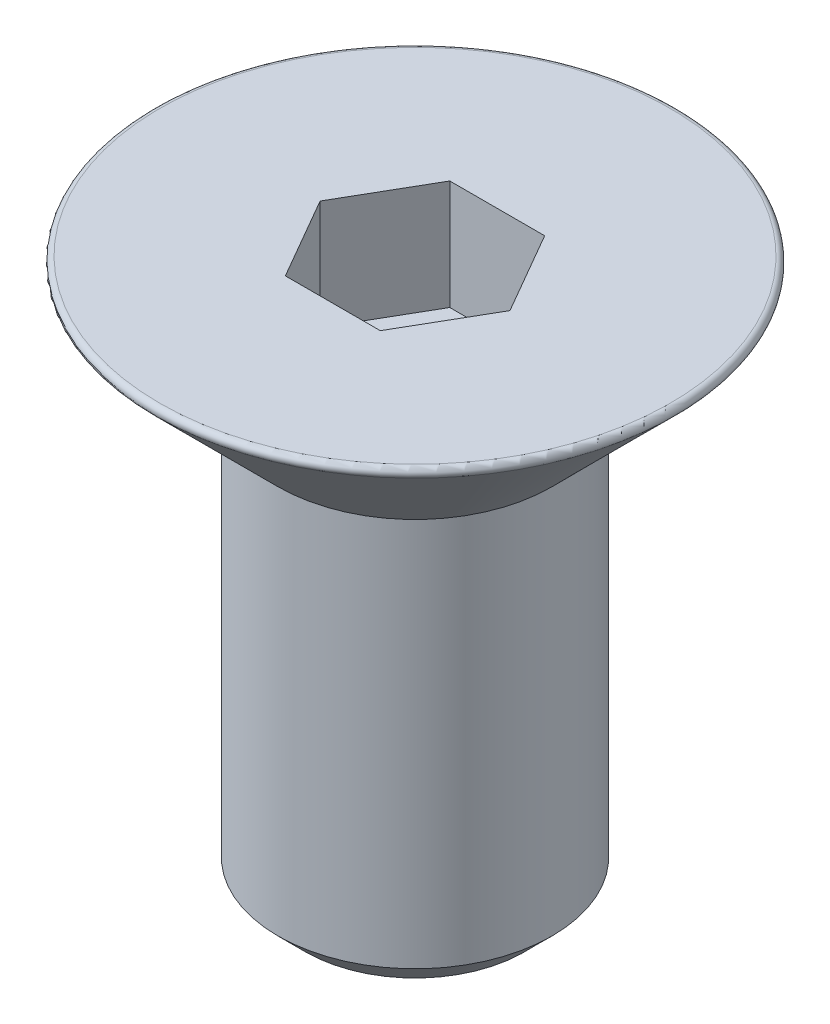
ISO-10303-21;
HEADER;
FILE_DESCRIPTION(('STEP AP214'),'2;1');
FILE_NAME('part.step','',(''),(''),'','','');
FILE_SCHEMA(('AUTOMOTIVE_DESIGN { 1 0 10303 214 1 1 1 1 }'));
ENDSEC;
DATA;
#1=APPLICATION_CONTEXT('core data for automotive mechanical design processes');
#2=APPLICATION_PROTOCOL_DEFINITION('international standard','automotive_design',2000,#1);
#3=PRODUCT_CONTEXT('',#1,'mechanical');
#4=PRODUCT('Part','Part','',(#3));
#5=PRODUCT_RELATED_PRODUCT_CATEGORY('part','',(#4));
#6=PRODUCT_DEFINITION_FORMATION('','',#4);
#7=PRODUCT_DEFINITION_CONTEXT('part definition',#1,'design');
#8=PRODUCT_DEFINITION('design','',#6,#7);
#9=PRODUCT_DEFINITION_SHAPE('','',#8);
#10=(LENGTH_UNIT() NAMED_UNIT(*) SI_UNIT(.MILLI.,.METRE.));
#11=(NAMED_UNIT(*) PLANE_ANGLE_UNIT() SI_UNIT($,.RADIAN.));
#12=(NAMED_UNIT(*) SI_UNIT($,.STERADIAN.) SOLID_ANGLE_UNIT());
#13=UNCERTAINTY_MEASURE_WITH_UNIT(LENGTH_MEASURE(1.E-05),#10,'distance_accuracy_value','');
#14=(GEOMETRIC_REPRESENTATION_CONTEXT(3) GLOBAL_UNCERTAINTY_ASSIGNED_CONTEXT((#13)) GLOBAL_UNIT_ASSIGNED_CONTEXT((#10,
#11,#12)) REPRESENTATION_CONTEXT('',''));
#15=CARTESIAN_POINT('',(0.,0.,0.));
#16=DIRECTION('',(0.,0.,1.));
#17=DIRECTION('',(1.,0.,0.));
#18=AXIS2_PLACEMENT_3D('',#15,#16,#17);
#19=CARTESIAN_POINT('',(0.,0.,0.));
#20=DIRECTION('',(0.,-1.,0.));
#21=DIRECTION('',(0.,0.,-1.));
#22=AXIS2_PLACEMENT_3D('',#19,#20,#21);
#23=PLANE('',#22);
#24=CARTESIAN_POINT('',(0.,-5.6843418860808E-11,0.));
#25=DIRECTION('',(0.,1.,0.));
#26=DIRECTION('',(0.,0.,1.));
#27=AXIS2_PLACEMENT_3D('',#24,#25,#26);
#28=CIRCLE('',#27,2.00000000000955);
#29=CARTESIAN_POINT('',(0.,-5.6843418860808E-11,2.00000000000955));
#30=VERTEX_POINT('',#29);
#31=EDGE_CURVE('E21',#30,#30,#28,.T.);
#32=ORIENTED_EDGE('',*,*,#31,.F.);
#33=EDGE_LOOP('',(#32));
#34=FACE_BOUND('',#33,.T.);
#35=ADVANCED_FACE('F17',(#34),#23,.T.);
#36=CARTESIAN_POINT('',(0.,0.499999999988177,0.));
#37=DIRECTION('',(0.,1.,0.));
#38=DIRECTION('',(0.,0.,1.));
#39=AXIS2_PLACEMENT_3D('',#36,#37,#38);
#40=CONICAL_SURFACE('',#39,2.49999999994088,0.785398163283761);
#41=ORIENTED_EDGE('',*,*,#31,.T.);
#42=EDGE_LOOP('',(#41));
#43=FACE_BOUND('',#42,.T.);
#44=CARTESIAN_POINT('',(0.,0.500000000000005,0.));
#45=DIRECTION('',(0.,-1.,0.));
#46=DIRECTION('',(0.,0.,-1.));
#47=AXIS2_PLACEMENT_3D('',#44,#45,#46);
#48=CIRCLE('',#47,2.5);
#49=CARTESIAN_POINT('',(0.,0.500000000000005,-2.5));
#50=VERTEX_POINT('',#49);
#51=EDGE_CURVE('E90',#50,#50,#48,.F.);
#52=ORIENTED_EDGE('',*,*,#51,.F.);
#53=EDGE_LOOP('',(#52));
#54=FACE_BOUND('',#53,.T.);
#55=ADVANCED_FACE('F181',(#43,#54),#40,.T.);
#56=CARTESIAN_POINT('',(0.,0.,0.));
#57=DIRECTION('',(0.,-1.,0.));
#58=DIRECTION('',(0.,0.,-1.));
#59=AXIS2_PLACEMENT_3D('',#56,#57,#58);
#60=CYLINDRICAL_SURFACE('',#59,2.5);
#61=CARTESIAN_POINT('',(0.,7.60000000008176,0.));
#62=DIRECTION('',(0.,1.,0.));
#63=DIRECTION('',(0.,0.,1.));
#64=AXIS2_PLACEMENT_3D('',#61,#62,#63);
#65=CIRCLE('',#64,2.49999999999773);
#66=CARTESIAN_POINT('',(0.,7.60000000008176,2.49999999999773));
#67=VERTEX_POINT('',#66);
#68=EDGE_CURVE('E82',#67,#67,#65,.T.);
#69=ORIENTED_EDGE('',*,*,#68,.F.);
#70=EDGE_LOOP('',(#69));
#71=FACE_BOUND('',#70,.T.);
#72=ORIENTED_EDGE('',*,*,#51,.T.);
#73=EDGE_LOOP('',(#72));
#74=FACE_BOUND('',#73,.T.);
#75=ADVANCED_FACE('F178',(#71,#74),#60,.T.);
#76=CARTESIAN_POINT('',(0.866025403784438,8.,1.5));
#77=DIRECTION('',(0.866025403784439,0.,0.5));
#78=DIRECTION('',(0.5,0.,-0.866025403784439));
#79=AXIS2_PLACEMENT_3D('',#76,#77,#78);
#80=PLANE('',#79);
#81=DIRECTION('',(0.5,0.,-0.866025403784439));
#82=VECTOR('',#81,1.);
#83=CARTESIAN_POINT('',(0.866025403784438,8.,1.5));
#84=LINE('',#83,#82);
#85=CARTESIAN_POINT('',(0.866025403784438,8.,1.5));
#86=VERTEX_POINT('',#85);
#87=CARTESIAN_POINT('',(1.73205080756888,8.,0.));
#88=VERTEX_POINT('',#87);
#89=EDGE_CURVE('E66',#86,#88,#84,.T.);
#90=ORIENTED_EDGE('',*,*,#89,.F.);
#91=DIRECTION('',(0.,1.,0.));
#92=VECTOR('',#91,1.);
#93=CARTESIAN_POINT('',(0.866025403784439,8.,1.5));
#94=LINE('',#93,#92);
#95=CARTESIAN_POINT('',(0.866025403784438,10.,1.5));
#96=VERTEX_POINT('',#95);
#97=EDGE_CURVE('E88',#86,#96,#94,.T.);
#98=ORIENTED_EDGE('',*,*,#97,.T.);
#99=DIRECTION('',(0.5,0.,-0.866025403784439));
#100=VECTOR('',#99,1.);
#101=CARTESIAN_POINT('',(0.866025403784438,10.,1.5));
#102=LINE('',#101,#100);
#103=CARTESIAN_POINT('',(1.73205080756888,10.,0.));
#104=VERTEX_POINT('',#103);
#105=EDGE_CURVE('E74',#104,#96,#102,.F.);
#106=ORIENTED_EDGE('',*,*,#105,.F.);
#107=DIRECTION('',(0.,1.,0.));
#108=VECTOR('',#107,1.);
#109=CARTESIAN_POINT('',(1.73205080756888,8.,0.));
#110=LINE('',#109,#108);
#111=EDGE_CURVE('E81',#104,#88,#110,.F.);
#112=ORIENTED_EDGE('',*,*,#111,.T.);
#113=EDGE_LOOP('',(#90,#98,#106,#112));
#114=FACE_BOUND('',#113,.T.);
#115=ADVANCED_FACE('F85',(#114),#80,.F.);
#116=CARTESIAN_POINT('',(0.,9.82928932194227,0.));
#117=DIRECTION('',(0.,1.,0.));
#118=DIRECTION('',(0.,0.,1.));
#119=AXIS2_PLACEMENT_3D('',#116,#117,#118);
#120=CONICAL_SURFACE('',#119,4.72928932174455,0.78539816337195);
#121=ORIENTED_EDGE('',*,*,#68,.T.);
#122=EDGE_LOOP('',(#121));
#123=FACE_BOUND('',#122,.T.);
#124=CARTESIAN_POINT('',(0.,9.82928932183933,0.));
#125=DIRECTION('',(0.,1.,0.));
#126=DIRECTION('',(0.,0.,1.));
#127=AXIS2_PLACEMENT_3D('',#124,#125,#126);
#128=CIRCLE('',#127,4.72928932183933);
#129=CARTESIAN_POINT('',(0.,9.82928932183933,4.72928932183933));
#130=VERTEX_POINT('',#129);
#131=EDGE_CURVE('E99',#130,#130,#128,.T.);
#132=ORIENTED_EDGE('',*,*,#131,.F.);
#133=EDGE_LOOP('',(#132));
#134=FACE_BOUND('',#133,.T.);
#135=ADVANCED_FACE('F172',(#123,#134),#120,.T.);
#136=CARTESIAN_POINT('',(1.73205080756888,8.,0.));
#137=DIRECTION('',(0.866025403784438,0.,-0.5));
#138=DIRECTION('',(-0.5,0.,-0.866025403784438));
#139=AXIS2_PLACEMENT_3D('',#136,#137,#138);
#140=PLANE('',#139);
#141=DIRECTION('',(-0.5,0.,-0.866025403784438));
#142=VECTOR('',#141,1.);
#143=CARTESIAN_POINT('',(1.73205080756888,8.,0.));
#144=LINE('',#143,#142);
#145=CARTESIAN_POINT('',(0.866025403784438,8.,-1.5));
#146=VERTEX_POINT('',#145);
#147=EDGE_CURVE('E93',#88,#146,#144,.T.);
#148=ORIENTED_EDGE('',*,*,#147,.F.);
#149=ORIENTED_EDGE('',*,*,#111,.F.);
#150=DIRECTION('',(-0.5,0.,-0.866025403784438));
#151=VECTOR('',#150,1.);
#152=CARTESIAN_POINT('',(1.73205080756888,10.,0.));
#153=LINE('',#152,#151);
#154=CARTESIAN_POINT('',(0.866025403784438,10.,-1.5));
#155=VERTEX_POINT('',#154);
#156=EDGE_CURVE('E70',#155,#104,#153,.F.);
#157=ORIENTED_EDGE('',*,*,#156,.F.);
#158=DIRECTION('',(0.,1.,0.));
#159=VECTOR('',#158,1.);
#160=CARTESIAN_POINT('',(0.866025403784438,8.,-1.5));
#161=LINE('',#160,#159);
#162=EDGE_CURVE('E131',#155,#146,#161,.F.);
#163=ORIENTED_EDGE('',*,*,#162,.T.);
#164=EDGE_LOOP('',(#148,#149,#157,#163));
#165=FACE_BOUND('',#164,.T.);
#166=ADVANCED_FACE('F92',(#165),#140,.F.);
#167=CARTESIAN_POINT('',(-0.866025403784439,8.,1.5));
#168=DIRECTION('',(0.,0.,1.));
#169=DIRECTION('',(1.,0.,0.));
#170=AXIS2_PLACEMENT_3D('',#167,#168,#169);
#171=PLANE('',#170);
#172=DIRECTION('',(1.,0.,0.));
#173=VECTOR('',#172,1.);
#174=CARTESIAN_POINT('',(1.73205080756888,8.,1.5));
#175=LINE('',#174,#173);
#176=CARTESIAN_POINT('',(-0.866025403784439,8.,1.5));
#177=VERTEX_POINT('',#176);
#178=EDGE_CURVE('E129',#177,#86,#175,.T.);
#179=ORIENTED_EDGE('',*,*,#178,.F.);
#180=DIRECTION('',(0.,1.,0.));
#181=VECTOR('',#180,1.);
#182=CARTESIAN_POINT('',(-0.866025403784439,8.,1.5));
#183=LINE('',#182,#181);
#184=CARTESIAN_POINT('',(-0.866025403784439,10.,1.5));
#185=VERTEX_POINT('',#184);
#186=EDGE_CURVE('E119',#177,#185,#183,.T.);
#187=ORIENTED_EDGE('',*,*,#186,.T.);
#188=DIRECTION('',(1.,0.,0.));
#189=VECTOR('',#188,1.);
#190=CARTESIAN_POINT('',(-0.866025403784439,10.,1.5));
#191=LINE('',#190,#189);
#192=EDGE_CURVE('E95',#96,#185,#191,.F.);
#193=ORIENTED_EDGE('',*,*,#192,.F.);
#194=ORIENTED_EDGE('',*,*,#97,.F.);
#195=EDGE_LOOP('',(#179,#187,#193,#194));
#196=FACE_BOUND('',#195,.T.);
#197=ADVANCED_FACE('F136',(#196),#171,.F.);
#198=CARTESIAN_POINT('',(0.866025403784438,8.,-1.5));
#199=DIRECTION('',(0.,0.,-1.));
#200=DIRECTION('',(-1.,0.,0.));
#201=AXIS2_PLACEMENT_3D('',#198,#199,#200);
#202=PLANE('',#201);
#203=DIRECTION('',(1.,0.,0.));
#204=VECTOR('',#203,1.);
#205=CARTESIAN_POINT('',(1.73205080756888,8.,-1.5));
#206=LINE('',#205,#204);
#207=CARTESIAN_POINT('',(-0.866025403784439,8.,-1.5));
#208=VERTEX_POINT('',#207);
#209=EDGE_CURVE('E126',#146,#208,#206,.F.);
#210=ORIENTED_EDGE('',*,*,#209,.F.);
#211=ORIENTED_EDGE('',*,*,#162,.F.);
#212=DIRECTION('',(-1.,0.,0.));
#213=VECTOR('',#212,1.);
#214=CARTESIAN_POINT('',(0.866025403784438,10.,-1.5));
#215=LINE('',#214,#213);
#216=CARTESIAN_POINT('',(-0.866025403784439,10.,-1.5));
#217=VERTEX_POINT('',#216);
#218=EDGE_CURVE('E76',#217,#155,#215,.F.);
#219=ORIENTED_EDGE('',*,*,#218,.F.);
#220=DIRECTION('',(0.,1.,0.));
#221=VECTOR('',#220,1.);
#222=CARTESIAN_POINT('',(-0.866025403784439,8.,-1.5));
#223=LINE('',#222,#221);
#224=EDGE_CURVE('E115',#217,#208,#223,.F.);
#225=ORIENTED_EDGE('',*,*,#224,.T.);
#226=EDGE_LOOP('',(#210,#211,#219,#225));
#227=FACE_BOUND('',#226,.T.);
#228=ADVANCED_FACE('F148',(#227),#202,.F.);
#229=CARTESIAN_POINT('',(1.73205080756888,8.,0.));
#230=DIRECTION('',(0.,1.,0.));
#231=DIRECTION('',(0.,0.,1.));
#232=AXIS2_PLACEMENT_3D('',#229,#230,#231);
#233=PLANE('',#232);
#234=ORIENTED_EDGE('',*,*,#209,.T.);
#235=DIRECTION('',(-0.5,0.,0.866025403784439));
#236=VECTOR('',#235,1.);
#237=CARTESIAN_POINT('',(-0.866025403784439,8.,-1.5));
#238=LINE('',#237,#236);
#239=CARTESIAN_POINT('',(-1.73205080756888,8.,0.));
#240=VERTEX_POINT('',#239);
#241=EDGE_CURVE('E109',#208,#240,#238,.T.);
#242=ORIENTED_EDGE('',*,*,#241,.T.);
#243=DIRECTION('',(0.5,0.,0.866025403784439));
#244=VECTOR('',#243,1.);
#245=CARTESIAN_POINT('',(-1.73205080756888,8.,0.));
#246=LINE('',#245,#244);
#247=EDGE_CURVE('E122',#240,#177,#246,.T.);
#248=ORIENTED_EDGE('',*,*,#247,.T.);
#249=ORIENTED_EDGE('',*,*,#178,.T.);
#250=ORIENTED_EDGE('',*,*,#89,.T.);
#251=ORIENTED_EDGE('',*,*,#147,.T.);
#252=EDGE_LOOP('',(#234,#242,#248,#249,#250,#251));
#253=FACE_BOUND('',#252,.T.);
#254=ADVANCED_FACE('F139',(#253),#233,.T.);
#255=CARTESIAN_POINT('',(-1.73205080756888,8.,0.));
#256=DIRECTION('',(-0.866025403784439,0.,0.5));
#257=DIRECTION('',(0.5,0.,0.866025403784439));
#258=AXIS2_PLACEMENT_3D('',#255,#256,#257);
#259=PLANE('',#258);
#260=ORIENTED_EDGE('',*,*,#247,.F.);
#261=DIRECTION('',(0.,1.,0.));
#262=VECTOR('',#261,1.);
#263=CARTESIAN_POINT('',(-1.73205080756888,8.,0.));
#264=LINE('',#263,#262);
#265=CARTESIAN_POINT('',(-1.73205080756888,10.,0.));
#266=VERTEX_POINT('',#265);
#267=EDGE_CURVE('E107',#240,#266,#264,.T.);
#268=ORIENTED_EDGE('',*,*,#267,.T.);
#269=DIRECTION('',(0.5,0.,0.866025403784439));
#270=VECTOR('',#269,1.);
#271=CARTESIAN_POINT('',(-1.73205080756888,10.,0.));
#272=LINE('',#271,#270);
#273=EDGE_CURVE('E35',#185,#266,#272,.F.);
#274=ORIENTED_EDGE('',*,*,#273,.F.);
#275=ORIENTED_EDGE('',*,*,#186,.F.);
#276=EDGE_LOOP('',(#260,#268,#274,#275));
#277=FACE_BOUND('',#276,.T.);
#278=ADVANCED_FACE('F137',(#277),#259,.F.);
#279=CARTESIAN_POINT('',(0.,9.9,0.));
#280=DIRECTION('',(0.,1.,0.));
#281=DIRECTION('',(0.,0.,1.));
#282=AXIS2_PLACEMENT_3D('',#279,#280,#281);
#283=TOROIDAL_SURFACE('',#282,4.65857864376269,0.0999999999999998);
#284=ORIENTED_EDGE('',*,*,#131,.T.);
#285=EDGE_LOOP('',(#284));
#286=FACE_BOUND('',#285,.T.);
#287=CARTESIAN_POINT('',(0.,10.,0.));
#288=DIRECTION('',(0.,1.,0.));
#289=DIRECTION('',(0.,0.,1.));
#290=AXIS2_PLACEMENT_3D('',#287,#288,#289);
#291=CIRCLE('',#290,4.65857864376269);
#292=CARTESIAN_POINT('',(0.,10.,4.65857864376269));
#293=VERTEX_POINT('',#292);
#294=EDGE_CURVE('E27',#293,#293,#291,.T.);
#295=ORIENTED_EDGE('',*,*,#294,.F.);
#296=EDGE_LOOP('',(#295));
#297=FACE_BOUND('',#296,.T.);
#298=ADVANCED_FACE('F19',(#286,#297),#283,.T.);
#299=CARTESIAN_POINT('',(-0.866025403784439,8.,-1.5));
#300=DIRECTION('',(-0.866025403784439,0.,-0.5));
#301=DIRECTION('',(-0.5,0.,0.866025403784439));
#302=AXIS2_PLACEMENT_3D('',#299,#300,#301);
#303=PLANE('',#302);
#304=ORIENTED_EDGE('',*,*,#241,.F.);
#305=ORIENTED_EDGE('',*,*,#224,.F.);
#306=DIRECTION('',(0.5,0.,-0.866025403784439));
#307=VECTOR('',#306,1.);
#308=CARTESIAN_POINT('',(-1.73205080756888,10.,0.));
#309=LINE('',#308,#307);
#310=EDGE_CURVE('E11',#266,#217,#309,.T.);
#311=ORIENTED_EDGE('',*,*,#310,.F.);
#312=ORIENTED_EDGE('',*,*,#267,.F.);
#313=EDGE_LOOP('',(#304,#305,#311,#312));
#314=FACE_BOUND('',#313,.T.);
#315=ADVANCED_FACE('F146',(#314),#303,.F.);
#316=CARTESIAN_POINT('',(0.,10.,-4.9));
#317=DIRECTION('',(0.,1.,0.));
#318=DIRECTION('',(0.,0.,1.));
#319=AXIS2_PLACEMENT_3D('',#316,#317,#318);
#320=PLANE('',#319);
#321=ORIENTED_EDGE('',*,*,#273,.T.);
#322=ORIENTED_EDGE('',*,*,#310,.T.);
#323=ORIENTED_EDGE('',*,*,#218,.T.);
#324=ORIENTED_EDGE('',*,*,#156,.T.);
#325=ORIENTED_EDGE('',*,*,#105,.T.);
#326=ORIENTED_EDGE('',*,*,#192,.T.);
#327=EDGE_LOOP('',(#321,#322,#323,#324,#325,#326));
#328=FACE_BOUND('',#327,.T.);
#329=ORIENTED_EDGE('',*,*,#294,.T.);
#330=EDGE_LOOP('',(#329));
#331=FACE_BOUND('',#330,.T.);
#332=ADVANCED_FACE('F72',(#328,#331),#320,.T.);
#333=CLOSED_SHELL('',(#35,#55,#75,#115,#135,#166,#197,#228,#254,#278,#298,#315,#332));
#334=MANIFOLD_SOLID_BREP('B1',#333);
#335=ADVANCED_BREP_SHAPE_REPRESENTATION('',(#18,#334),#14);
#336=SHAPE_DEFINITION_REPRESENTATION(#9,#335);
ENDSEC;
END-ISO-10303-21;
